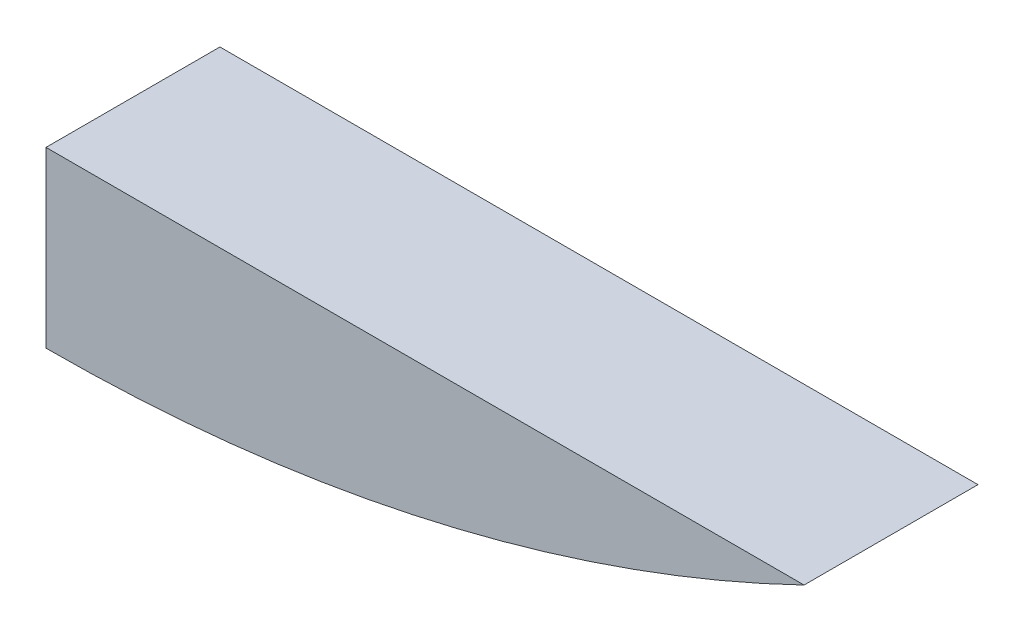
ISO-10303-21;
HEADER;
FILE_DESCRIPTION(('STEP AP214'),'2;1');
FILE_NAME('part.step','',(''),(''),'','','');
FILE_SCHEMA(('AUTOMOTIVE_DESIGN { 1 0 10303 214 1 1 1 1 }'));
ENDSEC;
DATA;
#1=APPLICATION_CONTEXT('core data for automotive mechanical design processes');
#2=APPLICATION_PROTOCOL_DEFINITION('international standard','automotive_design',2000,#1);
#3=PRODUCT_CONTEXT('',#1,'mechanical');
#4=PRODUCT('Part','Part','',(#3));
#5=PRODUCT_RELATED_PRODUCT_CATEGORY('part','',(#4));
#6=PRODUCT_DEFINITION_FORMATION('','',#4);
#7=PRODUCT_DEFINITION_CONTEXT('part definition',#1,'design');
#8=PRODUCT_DEFINITION('design','',#6,#7);
#9=PRODUCT_DEFINITION_SHAPE('','',#8);
#10=(LENGTH_UNIT() NAMED_UNIT(*) SI_UNIT(.MILLI.,.METRE.));
#11=(NAMED_UNIT(*) PLANE_ANGLE_UNIT() SI_UNIT($,.RADIAN.));
#12=(NAMED_UNIT(*) SI_UNIT($,.STERADIAN.) SOLID_ANGLE_UNIT());
#13=UNCERTAINTY_MEASURE_WITH_UNIT(LENGTH_MEASURE(1.E-05),#10,'distance_accuracy_value','');
#14=(GEOMETRIC_REPRESENTATION_CONTEXT(3) GLOBAL_UNCERTAINTY_ASSIGNED_CONTEXT((#13)) GLOBAL_UNIT_ASSIGNED_CONTEXT((#10,
#11,#12)) REPRESENTATION_CONTEXT('',''));
#15=CARTESIAN_POINT('',(0.,0.,0.));
#16=DIRECTION('',(0.,0.,1.));
#17=DIRECTION('',(1.,0.,0.));
#18=AXIS2_PLACEMENT_3D('',#15,#16,#17);
#19=CARTESIAN_POINT('',(597.266258042068,0.,0.));
#20=DIRECTION('',(-1.,0.,0.));
#21=DIRECTION('',(0.,0.,1.));
#22=AXIS2_PLACEMENT_3D('',#19,#20,#21);
#23=PLANE('',#22);
#24=DIRECTION('',(0.,0.,1.));
#25=VECTOR('',#24,1.);
#26=CARTESIAN_POINT('',(597.266258042068,-45.,0.));
#27=LINE('',#26,#25);
#28=CARTESIAN_POINT('',(597.266258042068,-45.,0.));
#29=VERTEX_POINT('',#28);
#30=CARTESIAN_POINT('',(597.266258042068,-45.,5.));
#31=VERTEX_POINT('',#30);
#32=EDGE_CURVE('E70',#29,#31,#27,.T.);
#33=ORIENTED_EDGE('',*,*,#32,.F.);
#34=DIRECTION('',(0.,-1.,0.));
#35=VECTOR('',#34,1.);
#36=CARTESIAN_POINT('',(597.266258042068,0.,0.));
#37=LINE('',#36,#35);
#38=CARTESIAN_POINT('',(597.266258042068,-50.,0.));
#39=VERTEX_POINT('',#38);
#40=EDGE_CURVE('E75',#29,#39,#37,.T.);
#41=ORIENTED_EDGE('',*,*,#40,.T.);
#42=DIRECTION('',(0.,0.,-1.));
#43=VECTOR('',#42,1.);
#44=CARTESIAN_POINT('',(597.266258042068,-50.,80.));
#45=LINE('',#44,#43);
#46=CARTESIAN_POINT('',(597.266258042068,-50.,5.));
#47=VERTEX_POINT('',#46);
#48=EDGE_CURVE('E85',#47,#39,#45,.T.);
#49=ORIENTED_EDGE('',*,*,#48,.F.);
#50=DIRECTION('',(0.,-1.,0.));
#51=VECTOR('',#50,1.);
#52=CARTESIAN_POINT('',(597.266258042068,-45.,5.));
#53=LINE('',#52,#51);
#54=EDGE_CURVE('E77',#31,#47,#53,.T.);
#55=ORIENTED_EDGE('',*,*,#54,.F.);
#56=EDGE_LOOP('',(#33,#41,#49,#55));
#57=FACE_BOUND('',#56,.T.);
#58=ADVANCED_FACE('F34',(#57),#23,.T.);
#59=CARTESIAN_POINT('',(-502.733741957931,0.,0.));
#60=DIRECTION('',(0.,0.,1.));
#61=DIRECTION('',(1.,0.,0.));
#62=AXIS2_PLACEMENT_3D('',#59,#60,#61);
#63=PLANE('',#62);
#64=ORIENTED_EDGE('',*,*,#40,.F.);
#65=DIRECTION('',(-1.,0.,0.));
#66=VECTOR('',#65,1.);
#67=CARTESIAN_POINT('',(-502.733741957931,-45.,0.));
#68=LINE('',#67,#66);
#69=CARTESIAN_POINT('',(619.060752759772,-45.,0.));
#70=VERTEX_POINT('',#69);
#71=EDGE_CURVE('E38',#70,#29,#68,.T.);
#72=ORIENTED_EDGE('',*,*,#71,.F.);
#73=CARTESIAN_POINT('',(597.266258042068,0.,0.));
#74=DIRECTION('',(0.,0.,1.));
#75=DIRECTION('',(1.,0.,0.));
#76=AXIS2_PLACEMENT_3D('',#73,#74,#75);
#77=CIRCLE('',#76,50.);
#78=EDGE_CURVE('E50',#39,#70,#77,.T.);
#79=ORIENTED_EDGE('',*,*,#78,.F.);
#80=EDGE_LOOP('',(#64,#72,#79));
#81=FACE_BOUND('',#80,.T.);
#82=ADVANCED_FACE('F79',(#81),#63,.F.);
#83=CARTESIAN_POINT('',(597.266258042068,0.,80.));
#84=DIRECTION('',(0.,0.,-1.));
#85=DIRECTION('',(-1.,0.,0.));
#86=AXIS2_PLACEMENT_3D('',#83,#84,#85);
#87=CYLINDRICAL_SURFACE('',#86,50.);
#88=DIRECTION('',(0.,0.,-1.));
#89=VECTOR('',#88,1.);
#90=CARTESIAN_POINT('',(619.060752759772,-45.,80.));
#91=LINE('',#90,#89);
#92=CARTESIAN_POINT('',(619.060752759772,-45.,5.));
#93=VERTEX_POINT('',#92);
#94=EDGE_CURVE('E11',#93,#70,#91,.T.);
#95=ORIENTED_EDGE('',*,*,#94,.F.);
#96=CARTESIAN_POINT('',(597.266258042068,0.,5.));
#97=DIRECTION('',(0.,0.,1.));
#98=DIRECTION('',(1.,0.,0.));
#99=AXIS2_PLACEMENT_3D('',#96,#97,#98);
#100=CIRCLE('',#99,50.);
#101=EDGE_CURVE('E82',#47,#93,#100,.T.);
#102=ORIENTED_EDGE('',*,*,#101,.F.);
#103=ORIENTED_EDGE('',*,*,#48,.T.);
#104=ORIENTED_EDGE('',*,*,#78,.T.);
#105=EDGE_LOOP('',(#95,#102,#103,#104));
#106=FACE_BOUND('',#105,.T.);
#107=ADVANCED_FACE('F90',(#106),#87,.T.);
#108=CARTESIAN_POINT('',(0.,-45.,0.));
#109=DIRECTION('',(0.,1.,0.));
#110=DIRECTION('',(0.,0.,1.));
#111=AXIS2_PLACEMENT_3D('',#108,#109,#110);
#112=PLANE('',#111);
#113=ORIENTED_EDGE('',*,*,#71,.T.);
#114=ORIENTED_EDGE('',*,*,#32,.T.);
#115=DIRECTION('',(-1.,0.,0.));
#116=VECTOR('',#115,1.);
#117=CARTESIAN_POINT('',(597.266258042068,-45.,5.));
#118=LINE('',#117,#116);
#119=EDGE_CURVE('E57',#93,#31,#118,.T.);
#120=ORIENTED_EDGE('',*,*,#119,.F.);
#121=ORIENTED_EDGE('',*,*,#94,.T.);
#122=EDGE_LOOP('',(#113,#114,#120,#121));
#123=FACE_BOUND('',#122,.T.);
#124=ADVANCED_FACE('F69',(#123),#112,.T.);
#125=CARTESIAN_POINT('',(597.266258042068,-45.,5.));
#126=DIRECTION('',(0.,0.,1.));
#127=DIRECTION('',(1.,0.,0.));
#128=AXIS2_PLACEMENT_3D('',#125,#126,#127);
#129=PLANE('',#128);
#130=ORIENTED_EDGE('',*,*,#119,.T.);
#131=ORIENTED_EDGE('',*,*,#54,.T.);
#132=ORIENTED_EDGE('',*,*,#101,.T.);
#133=EDGE_LOOP('',(#130,#131,#132));
#134=FACE_BOUND('',#133,.T.);
#135=ADVANCED_FACE('F36',(#134),#129,.T.);
#136=CLOSED_SHELL('',(#58,#82,#107,#124,#135));
#137=MANIFOLD_SOLID_BREP('B2',#136);
#138=ADVANCED_BREP_SHAPE_REPRESENTATION('',(#18,#137),#14);
#139=SHAPE_DEFINITION_REPRESENTATION(#9,#138);
ENDSEC;
END-ISO-10303-21;
